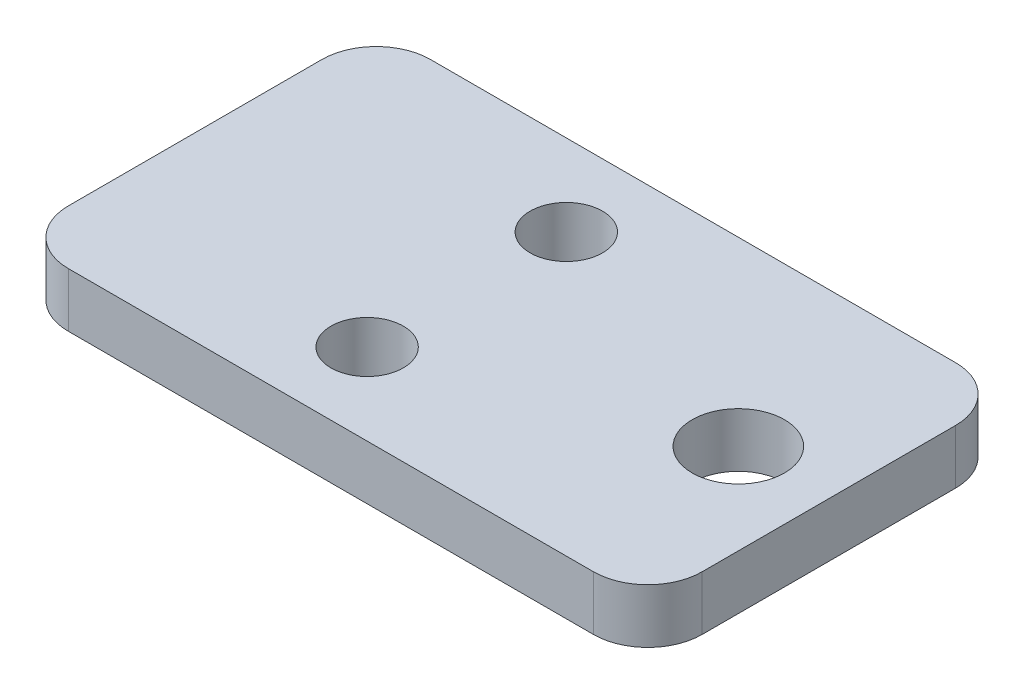
ISO-10303-21;
HEADER;
FILE_DESCRIPTION(('STEP AP214'),'2;1');
FILE_NAME('part.step','',(''),(''),'','','');
FILE_SCHEMA(('AUTOMOTIVE_DESIGN { 1 0 10303 214 1 1 1 1 }'));
ENDSEC;
DATA;
#1=APPLICATION_CONTEXT('core data for automotive mechanical design processes');
#2=APPLICATION_PROTOCOL_DEFINITION('international standard','automotive_design',2000,#1);
#3=PRODUCT_CONTEXT('',#1,'mechanical');
#4=PRODUCT('Part','Part','',(#3));
#5=PRODUCT_RELATED_PRODUCT_CATEGORY('part','',(#4));
#6=PRODUCT_DEFINITION_FORMATION('','',#4);
#7=PRODUCT_DEFINITION_CONTEXT('part definition',#1,'design');
#8=PRODUCT_DEFINITION('design','',#6,#7);
#9=PRODUCT_DEFINITION_SHAPE('','',#8);
#10=(LENGTH_UNIT() NAMED_UNIT(*) SI_UNIT(.MILLI.,.METRE.));
#11=(NAMED_UNIT(*) PLANE_ANGLE_UNIT() SI_UNIT($,.RADIAN.));
#12=(NAMED_UNIT(*) SI_UNIT($,.STERADIAN.) SOLID_ANGLE_UNIT());
#13=UNCERTAINTY_MEASURE_WITH_UNIT(LENGTH_MEASURE(1.E-05),#10,'distance_accuracy_value','');
#14=(GEOMETRIC_REPRESENTATION_CONTEXT(3) GLOBAL_UNCERTAINTY_ASSIGNED_CONTEXT((#13)) GLOBAL_UNIT_ASSIGNED_CONTEXT((#10,
#11,#12)) REPRESENTATION_CONTEXT('',''));
#15=CARTESIAN_POINT('',(0.,0.,0.));
#16=DIRECTION('',(0.,0.,1.));
#17=DIRECTION('',(1.,0.,0.));
#18=AXIS2_PLACEMENT_3D('',#15,#16,#17);
#19=CARTESIAN_POINT('',(14.5,3.,-6.99999999999999));
#20=DIRECTION('',(0.,1.,0.));
#21=DIRECTION('',(0.,0.,1.));
#22=AXIS2_PLACEMENT_3D('',#19,#20,#21);
#23=PLANE('',#22);
#24=CARTESIAN_POINT('',(-2.5,3.,-5.5));
#25=DIRECTION('',(0.,1.,0.));
#26=DIRECTION('',(0.,0.,1.));
#27=AXIS2_PLACEMENT_3D('',#24,#25,#26);
#28=CIRCLE('',#27,2.);
#29=CARTESIAN_POINT('',(-2.5,3.,-3.49999999999999));
#30=VERTEX_POINT('',#29);
#31=EDGE_CURVE('E184',#30,#30,#28,.T.);
#32=ORIENTED_EDGE('',*,*,#31,.F.);
#33=EDGE_LOOP('',(#32));
#34=FACE_BOUND('',#33,.T.);
#35=CARTESIAN_POINT('',(14.5,3.,-6.99999999999999));
#36=DIRECTION('',(0.,1.,0.));
#37=DIRECTION('',(0.,0.,1.));
#38=AXIS2_PLACEMENT_3D('',#35,#36,#37);
#39=CIRCLE('',#38,3.);
#40=CARTESIAN_POINT('',(17.5,3.,-6.99999999999999));
#41=VERTEX_POINT('',#40);
#42=CARTESIAN_POINT('',(14.5,3.,-9.99999999999999));
#43=VERTEX_POINT('',#42);
#44=EDGE_CURVE('E147',#41,#43,#39,.T.);
#45=ORIENTED_EDGE('',*,*,#44,.T.);
#46=DIRECTION('',(-1.,0.,0.));
#47=VECTOR('',#46,1.);
#48=CARTESIAN_POINT('',(-14.5,3.,-9.99999999999999));
#49=LINE('',#48,#47);
#50=CARTESIAN_POINT('',(-14.5,3.,-9.99999999999999));
#51=VERTEX_POINT('',#50);
#52=EDGE_CURVE('E95',#43,#51,#49,.T.);
#53=ORIENTED_EDGE('',*,*,#52,.T.);
#54=CARTESIAN_POINT('',(-14.5,3.,-6.99999999999999));
#55=DIRECTION('',(0.,1.,0.));
#56=DIRECTION('',(0.,0.,-1.));
#57=AXIS2_PLACEMENT_3D('',#54,#55,#56);
#58=CIRCLE('',#57,3.);
#59=CARTESIAN_POINT('',(-17.5,3.,-6.99999999999999));
#60=VERTEX_POINT('',#59);
#61=EDGE_CURVE('E162',#51,#60,#58,.T.);
#62=ORIENTED_EDGE('',*,*,#61,.T.);
#63=DIRECTION('',(0.,0.,1.));
#64=VECTOR('',#63,1.);
#65=CARTESIAN_POINT('',(-17.5,3.,-6.99999999999999));
#66=LINE('',#65,#64);
#67=CARTESIAN_POINT('',(-17.5,3.,7.));
#68=VERTEX_POINT('',#67);
#69=EDGE_CURVE('E175',#60,#68,#66,.T.);
#70=ORIENTED_EDGE('',*,*,#69,.T.);
#71=CARTESIAN_POINT('',(-14.5,3.,7.));
#72=DIRECTION('',(0.,1.,0.));
#73=DIRECTION('',(0.,0.,1.));
#74=AXIS2_PLACEMENT_3D('',#71,#72,#73);
#75=CIRCLE('',#74,3.);
#76=CARTESIAN_POINT('',(-14.5,3.,10.));
#77=VERTEX_POINT('',#76);
#78=EDGE_CURVE('E114',#68,#77,#75,.T.);
#79=ORIENTED_EDGE('',*,*,#78,.T.);
#80=DIRECTION('',(1.,0.,0.));
#81=VECTOR('',#80,1.);
#82=CARTESIAN_POINT('',(-14.5,3.,10.));
#83=LINE('',#82,#81);
#84=CARTESIAN_POINT('',(14.5,3.,10.));
#85=VERTEX_POINT('',#84);
#86=EDGE_CURVE('E108',#77,#85,#83,.T.);
#87=ORIENTED_EDGE('',*,*,#86,.T.);
#88=CARTESIAN_POINT('',(14.5,3.,7.));
#89=DIRECTION('',(0.,1.,0.));
#90=DIRECTION('',(0.,0.,-1.));
#91=AXIS2_PLACEMENT_3D('',#88,#89,#90);
#92=CIRCLE('',#91,3.);
#93=CARTESIAN_POINT('',(17.5,3.,7.));
#94=VERTEX_POINT('',#93);
#95=EDGE_CURVE('E112',#85,#94,#92,.T.);
#96=ORIENTED_EDGE('',*,*,#95,.T.);
#97=DIRECTION('',(0.,0.,-1.));
#98=VECTOR('',#97,1.);
#99=CARTESIAN_POINT('',(17.5,3.,-6.99999999999999));
#100=LINE('',#99,#98);
#101=EDGE_CURVE('E52',#94,#41,#100,.T.);
#102=ORIENTED_EDGE('',*,*,#101,.T.);
#103=EDGE_LOOP('',(#45,#53,#62,#70,#79,#87,#96,#102));
#104=FACE_BOUND('',#103,.T.);
#105=CARTESIAN_POINT('',(12.5,3.,0.));
#106=DIRECTION('',(0.,1.,0.));
#107=DIRECTION('',(0.,0.,1.));
#108=AXIS2_PLACEMENT_3D('',#105,#106,#107);
#109=CIRCLE('',#108,2.55);
#110=CARTESIAN_POINT('',(12.5,3.,2.55000000000001));
#111=VERTEX_POINT('',#110);
#112=EDGE_CURVE('E136',#111,#111,#109,.T.);
#113=ORIENTED_EDGE('',*,*,#112,.F.);
#114=EDGE_LOOP('',(#113));
#115=FACE_BOUND('',#114,.T.);
#116=CARTESIAN_POINT('',(-2.49999999999985,3.,5.5));
#117=DIRECTION('',(0.,1.,0.));
#118=DIRECTION('',(0.,0.,1.));
#119=AXIS2_PLACEMENT_3D('',#116,#117,#118);
#120=CIRCLE('',#119,2.);
#121=CARTESIAN_POINT('',(-2.49999999999985,3.,7.50000000000001));
#122=VERTEX_POINT('',#121);
#123=EDGE_CURVE('E190',#122,#122,#120,.T.);
#124=ORIENTED_EDGE('',*,*,#123,.F.);
#125=EDGE_LOOP('',(#124));
#126=FACE_BOUND('',#125,.T.);
#127=ADVANCED_FACE('F35',(#34,#104,#115,#126),#23,.T.);
#128=CARTESIAN_POINT('',(14.5,0.,-6.99999999999999));
#129=DIRECTION('',(0.,1.,0.));
#130=DIRECTION('',(0.,0.,1.));
#131=AXIS2_PLACEMENT_3D('',#128,#129,#130);
#132=PLANE('',#131);
#133=CARTESIAN_POINT('',(14.5,0.,-6.99999999999999));
#134=DIRECTION('',(0.,1.,0.));
#135=DIRECTION('',(0.,0.,1.));
#136=AXIS2_PLACEMENT_3D('',#133,#134,#135);
#137=CIRCLE('',#136,3.);
#138=CARTESIAN_POINT('',(17.5,0.,-6.99999999999999));
#139=VERTEX_POINT('',#138);
#140=CARTESIAN_POINT('',(14.5,0.,-9.99999999999999));
#141=VERTEX_POINT('',#140);
#142=EDGE_CURVE('E132',#139,#141,#137,.T.);
#143=ORIENTED_EDGE('',*,*,#142,.F.);
#144=DIRECTION('',(0.,0.,-1.));
#145=VECTOR('',#144,1.);
#146=CARTESIAN_POINT('',(17.5,0.,-6.99999999999999));
#147=LINE('',#146,#145);
#148=CARTESIAN_POINT('',(17.5,0.,7.));
#149=VERTEX_POINT('',#148);
#150=EDGE_CURVE('E87',#149,#139,#147,.T.);
#151=ORIENTED_EDGE('',*,*,#150,.F.);
#152=CARTESIAN_POINT('',(14.5,0.,7.));
#153=DIRECTION('',(0.,1.,0.));
#154=DIRECTION('',(0.,0.,-1.));
#155=AXIS2_PLACEMENT_3D('',#152,#153,#154);
#156=CIRCLE('',#155,3.);
#157=CARTESIAN_POINT('',(14.5,0.,10.));
#158=VERTEX_POINT('',#157);
#159=EDGE_CURVE('E81',#158,#149,#156,.T.);
#160=ORIENTED_EDGE('',*,*,#159,.F.);
#161=DIRECTION('',(1.,0.,0.));
#162=VECTOR('',#161,1.);
#163=CARTESIAN_POINT('',(-14.5,0.,10.));
#164=LINE('',#163,#162);
#165=CARTESIAN_POINT('',(-14.5,0.,10.));
#166=VERTEX_POINT('',#165);
#167=EDGE_CURVE('E122',#166,#158,#164,.T.);
#168=ORIENTED_EDGE('',*,*,#167,.F.);
#169=CARTESIAN_POINT('',(-14.5,0.,7.));
#170=DIRECTION('',(0.,1.,0.));
#171=DIRECTION('',(0.,0.,1.));
#172=AXIS2_PLACEMENT_3D('',#169,#170,#171);
#173=CIRCLE('',#172,3.);
#174=CARTESIAN_POINT('',(-17.5,0.,7.));
#175=VERTEX_POINT('',#174);
#176=EDGE_CURVE('E142',#175,#166,#173,.T.);
#177=ORIENTED_EDGE('',*,*,#176,.F.);
#178=DIRECTION('',(0.,0.,1.));
#179=VECTOR('',#178,1.);
#180=CARTESIAN_POINT('',(-17.5,0.,-6.99999999999999));
#181=LINE('',#180,#179);
#182=CARTESIAN_POINT('',(-17.5,0.,-6.99999999999999));
#183=VERTEX_POINT('',#182);
#184=EDGE_CURVE('E140',#183,#175,#181,.T.);
#185=ORIENTED_EDGE('',*,*,#184,.F.);
#186=CARTESIAN_POINT('',(-14.5,0.,-6.99999999999999));
#187=DIRECTION('',(0.,1.,0.));
#188=DIRECTION('',(0.,0.,-1.));
#189=AXIS2_PLACEMENT_3D('',#186,#187,#188);
#190=CIRCLE('',#189,3.);
#191=CARTESIAN_POINT('',(-14.5,0.,-9.99999999999999));
#192=VERTEX_POINT('',#191);
#193=EDGE_CURVE('E138',#192,#183,#190,.T.);
#194=ORIENTED_EDGE('',*,*,#193,.F.);
#195=DIRECTION('',(-1.,0.,0.));
#196=VECTOR('',#195,1.);
#197=CARTESIAN_POINT('',(-14.5,0.,-9.99999999999999));
#198=LINE('',#197,#196);
#199=EDGE_CURVE('E135',#141,#192,#198,.T.);
#200=ORIENTED_EDGE('',*,*,#199,.F.);
#201=EDGE_LOOP('',(#143,#151,#160,#168,#177,#185,#194,#200));
#202=FACE_BOUND('',#201,.T.);
#203=CARTESIAN_POINT('',(12.5,0.,0.));
#204=DIRECTION('',(0.,1.,0.));
#205=DIRECTION('',(0.,0.,1.));
#206=AXIS2_PLACEMENT_3D('',#203,#204,#205);
#207=CIRCLE('',#206,2.55);
#208=CARTESIAN_POINT('',(12.5,0.,2.55000000000001));
#209=VERTEX_POINT('',#208);
#210=EDGE_CURVE('E181',#209,#209,#207,.T.);
#211=ORIENTED_EDGE('',*,*,#210,.T.);
#212=EDGE_LOOP('',(#211));
#213=FACE_BOUND('',#212,.T.);
#214=CARTESIAN_POINT('',(-2.5,0.,-5.5));
#215=DIRECTION('',(0.,1.,0.));
#216=DIRECTION('',(0.,0.,1.));
#217=AXIS2_PLACEMENT_3D('',#214,#215,#216);
#218=CIRCLE('',#217,2.);
#219=CARTESIAN_POINT('',(-2.5,0.,-3.49999999999999));
#220=VERTEX_POINT('',#219);
#221=EDGE_CURVE('E187',#220,#220,#218,.T.);
#222=ORIENTED_EDGE('',*,*,#221,.T.);
#223=EDGE_LOOP('',(#222));
#224=FACE_BOUND('',#223,.T.);
#225=CARTESIAN_POINT('',(-2.49999999999985,0.,5.5));
#226=DIRECTION('',(0.,1.,0.));
#227=DIRECTION('',(0.,0.,1.));
#228=AXIS2_PLACEMENT_3D('',#225,#226,#227);
#229=CIRCLE('',#228,2.);
#230=CARTESIAN_POINT('',(-2.49999999999985,0.,7.50000000000001));
#231=VERTEX_POINT('',#230);
#232=EDGE_CURVE('E193',#231,#231,#229,.T.);
#233=ORIENTED_EDGE('',*,*,#232,.T.);
#234=EDGE_LOOP('',(#233));
#235=FACE_BOUND('',#234,.T.);
#236=ADVANCED_FACE('F166',(#202,#213,#224,#235),#132,.F.);
#237=CARTESIAN_POINT('',(14.5,3.,-6.99999999999999));
#238=DIRECTION('',(0.,-1.,0.));
#239=DIRECTION('',(0.,0.,-1.));
#240=AXIS2_PLACEMENT_3D('',#237,#238,#239);
#241=CYLINDRICAL_SURFACE('',#240,3.);
#242=ORIENTED_EDGE('',*,*,#142,.T.);
#243=DIRECTION('',(0.,-1.,0.));
#244=VECTOR('',#243,1.);
#245=CARTESIAN_POINT('',(14.5,3.,-9.99999999999999));
#246=LINE('',#245,#244);
#247=EDGE_CURVE('E11',#43,#141,#246,.T.);
#248=ORIENTED_EDGE('',*,*,#247,.F.);
#249=ORIENTED_EDGE('',*,*,#44,.F.);
#250=DIRECTION('',(0.,-1.,0.));
#251=VECTOR('',#250,1.);
#252=CARTESIAN_POINT('',(17.5,3.,-6.99999999999999));
#253=LINE('',#252,#251);
#254=EDGE_CURVE('E128',#41,#139,#253,.T.);
#255=ORIENTED_EDGE('',*,*,#254,.T.);
#256=EDGE_LOOP('',(#242,#248,#249,#255));
#257=FACE_BOUND('',#256,.T.);
#258=ADVANCED_FACE('F37',(#257),#241,.T.);
#259=CARTESIAN_POINT('',(-14.5,3.,-9.99999999999999));
#260=DIRECTION('',(0.,0.,1.));
#261=DIRECTION('',(1.,0.,0.));
#262=AXIS2_PLACEMENT_3D('',#259,#260,#261);
#263=PLANE('',#262);
#264=ORIENTED_EDGE('',*,*,#199,.T.);
#265=DIRECTION('',(0.,-1.,0.));
#266=VECTOR('',#265,1.);
#267=CARTESIAN_POINT('',(-14.5,3.,-9.99999999999999));
#268=LINE('',#267,#266);
#269=EDGE_CURVE('E44',#51,#192,#268,.T.);
#270=ORIENTED_EDGE('',*,*,#269,.F.);
#271=ORIENTED_EDGE('',*,*,#52,.F.);
#272=ORIENTED_EDGE('',*,*,#247,.T.);
#273=EDGE_LOOP('',(#264,#270,#271,#272));
#274=FACE_BOUND('',#273,.T.);
#275=ADVANCED_FACE('F226',(#274),#263,.F.);
#276=CARTESIAN_POINT('',(-14.5,3.,-6.99999999999999));
#277=DIRECTION('',(0.,-1.,0.));
#278=DIRECTION('',(0.,0.,-1.));
#279=AXIS2_PLACEMENT_3D('',#276,#277,#278);
#280=CYLINDRICAL_SURFACE('',#279,3.);
#281=ORIENTED_EDGE('',*,*,#193,.T.);
#282=DIRECTION('',(0.,-1.,0.));
#283=VECTOR('',#282,1.);
#284=CARTESIAN_POINT('',(-17.5,3.,-6.99999999999999));
#285=LINE('',#284,#283);
#286=EDGE_CURVE('E154',#60,#183,#285,.T.);
#287=ORIENTED_EDGE('',*,*,#286,.F.);
#288=ORIENTED_EDGE('',*,*,#61,.F.);
#289=ORIENTED_EDGE('',*,*,#269,.T.);
#290=EDGE_LOOP('',(#281,#287,#288,#289));
#291=FACE_BOUND('',#290,.T.);
#292=ADVANCED_FACE('F160',(#291),#280,.T.);
#293=CARTESIAN_POINT('',(-17.5,3.,-6.99999999999999));
#294=DIRECTION('',(1.,0.,0.));
#295=DIRECTION('',(0.,0.,-1.));
#296=AXIS2_PLACEMENT_3D('',#293,#294,#295);
#297=PLANE('',#296);
#298=ORIENTED_EDGE('',*,*,#184,.T.);
#299=DIRECTION('',(0.,-1.,0.));
#300=VECTOR('',#299,1.);
#301=CARTESIAN_POINT('',(-17.5,3.,7.));
#302=LINE('',#301,#300);
#303=EDGE_CURVE('E151',#68,#175,#302,.T.);
#304=ORIENTED_EDGE('',*,*,#303,.F.);
#305=ORIENTED_EDGE('',*,*,#69,.F.);
#306=ORIENTED_EDGE('',*,*,#286,.T.);
#307=EDGE_LOOP('',(#298,#304,#305,#306));
#308=FACE_BOUND('',#307,.T.);
#309=ADVANCED_FACE('F171',(#308),#297,.F.);
#310=CARTESIAN_POINT('',(-14.5,3.,7.));
#311=DIRECTION('',(0.,-1.,0.));
#312=DIRECTION('',(0.,0.,-1.));
#313=AXIS2_PLACEMENT_3D('',#310,#311,#312);
#314=CYLINDRICAL_SURFACE('',#313,3.);
#315=ORIENTED_EDGE('',*,*,#176,.T.);
#316=DIRECTION('',(0.,-1.,0.));
#317=VECTOR('',#316,1.);
#318=CARTESIAN_POINT('',(-14.5,3.,10.));
#319=LINE('',#318,#317);
#320=EDGE_CURVE('E123',#77,#166,#319,.T.);
#321=ORIENTED_EDGE('',*,*,#320,.F.);
#322=ORIENTED_EDGE('',*,*,#78,.F.);
#323=ORIENTED_EDGE('',*,*,#303,.T.);
#324=EDGE_LOOP('',(#315,#321,#322,#323));
#325=FACE_BOUND('',#324,.T.);
#326=ADVANCED_FACE('F174',(#325),#314,.T.);
#327=CARTESIAN_POINT('',(-14.5,3.,10.));
#328=DIRECTION('',(0.,0.,-1.));
#329=DIRECTION('',(-1.,0.,0.));
#330=AXIS2_PLACEMENT_3D('',#327,#328,#329);
#331=PLANE('',#330);
#332=ORIENTED_EDGE('',*,*,#167,.T.);
#333=DIRECTION('',(0.,-1.,0.));
#334=VECTOR('',#333,1.);
#335=CARTESIAN_POINT('',(14.5,3.,10.));
#336=LINE('',#335,#334);
#337=EDGE_CURVE('E119',#85,#158,#336,.T.);
#338=ORIENTED_EDGE('',*,*,#337,.F.);
#339=ORIENTED_EDGE('',*,*,#86,.F.);
#340=ORIENTED_EDGE('',*,*,#320,.T.);
#341=EDGE_LOOP('',(#332,#338,#339,#340));
#342=FACE_BOUND('',#341,.T.);
#343=ADVANCED_FACE('F120',(#342),#331,.F.);
#344=CARTESIAN_POINT('',(14.5,3.,7.));
#345=DIRECTION('',(0.,-1.,0.));
#346=DIRECTION('',(0.,0.,-1.));
#347=AXIS2_PLACEMENT_3D('',#344,#345,#346);
#348=CYLINDRICAL_SURFACE('',#347,3.);
#349=ORIENTED_EDGE('',*,*,#159,.T.);
#350=DIRECTION('',(0.,-1.,0.));
#351=VECTOR('',#350,1.);
#352=CARTESIAN_POINT('',(17.5,3.,7.));
#353=LINE('',#352,#351);
#354=EDGE_CURVE('E124',#94,#149,#353,.T.);
#355=ORIENTED_EDGE('',*,*,#354,.F.);
#356=ORIENTED_EDGE('',*,*,#95,.F.);
#357=ORIENTED_EDGE('',*,*,#337,.T.);
#358=EDGE_LOOP('',(#349,#355,#356,#357));
#359=FACE_BOUND('',#358,.T.);
#360=ADVANCED_FACE('F126',(#359),#348,.T.);
#361=CARTESIAN_POINT('',(17.5,3.,-6.99999999999999));
#362=DIRECTION('',(-1.,0.,0.));
#363=DIRECTION('',(0.,0.,1.));
#364=AXIS2_PLACEMENT_3D('',#361,#362,#363);
#365=PLANE('',#364);
#366=ORIENTED_EDGE('',*,*,#150,.T.);
#367=ORIENTED_EDGE('',*,*,#254,.F.);
#368=ORIENTED_EDGE('',*,*,#101,.F.);
#369=ORIENTED_EDGE('',*,*,#354,.T.);
#370=EDGE_LOOP('',(#366,#367,#368,#369));
#371=FACE_BOUND('',#370,.T.);
#372=ADVANCED_FACE('F214',(#371),#365,.F.);
#373=CARTESIAN_POINT('',(12.5,3.,0.));
#374=DIRECTION('',(0.,-1.,0.));
#375=DIRECTION('',(0.,0.,-1.));
#376=AXIS2_PLACEMENT_3D('',#373,#374,#375);
#377=CYLINDRICAL_SURFACE('',#376,2.55);
#378=ORIENTED_EDGE('',*,*,#112,.T.);
#379=EDGE_LOOP('',(#378));
#380=FACE_BOUND('',#379,.T.);
#381=ORIENTED_EDGE('',*,*,#210,.F.);
#382=EDGE_LOOP('',(#381));
#383=FACE_BOUND('',#382,.T.);
#384=ADVANCED_FACE('F211',(#380,#383),#377,.F.);
#385=CARTESIAN_POINT('',(-2.5,3.,-5.5));
#386=DIRECTION('',(0.,-1.,0.));
#387=DIRECTION('',(0.,0.,-1.));
#388=AXIS2_PLACEMENT_3D('',#385,#386,#387);
#389=CYLINDRICAL_SURFACE('',#388,2.);
#390=ORIENTED_EDGE('',*,*,#31,.T.);
#391=EDGE_LOOP('',(#390));
#392=FACE_BOUND('',#391,.T.);
#393=ORIENTED_EDGE('',*,*,#221,.F.);
#394=EDGE_LOOP('',(#393));
#395=FACE_BOUND('',#394,.T.);
#396=ADVANCED_FACE('F290',(#392,#395),#389,.F.);
#397=CARTESIAN_POINT('',(-2.49999999999985,3.,5.5));
#398=DIRECTION('',(0.,-1.,0.));
#399=DIRECTION('',(0.,0.,-1.));
#400=AXIS2_PLACEMENT_3D('',#397,#398,#399);
#401=CYLINDRICAL_SURFACE('',#400,2.);
#402=ORIENTED_EDGE('',*,*,#123,.T.);
#403=EDGE_LOOP('',(#402));
#404=FACE_BOUND('',#403,.T.);
#405=ORIENTED_EDGE('',*,*,#232,.F.);
#406=EDGE_LOOP('',(#405));
#407=FACE_BOUND('',#406,.T.);
#408=ADVANCED_FACE('F199',(#404,#407),#401,.F.);
#409=CLOSED_SHELL('',(#127,#236,#258,#275,#292,#309,#326,#343,#360,#372,#384,#396,#408));
#410=MANIFOLD_SOLID_BREP('B2',#409);
#411=ADVANCED_BREP_SHAPE_REPRESENTATION('',(#18,#410),#14);
#412=SHAPE_DEFINITION_REPRESENTATION(#9,#411);
ENDSEC;
END-ISO-10303-21;
